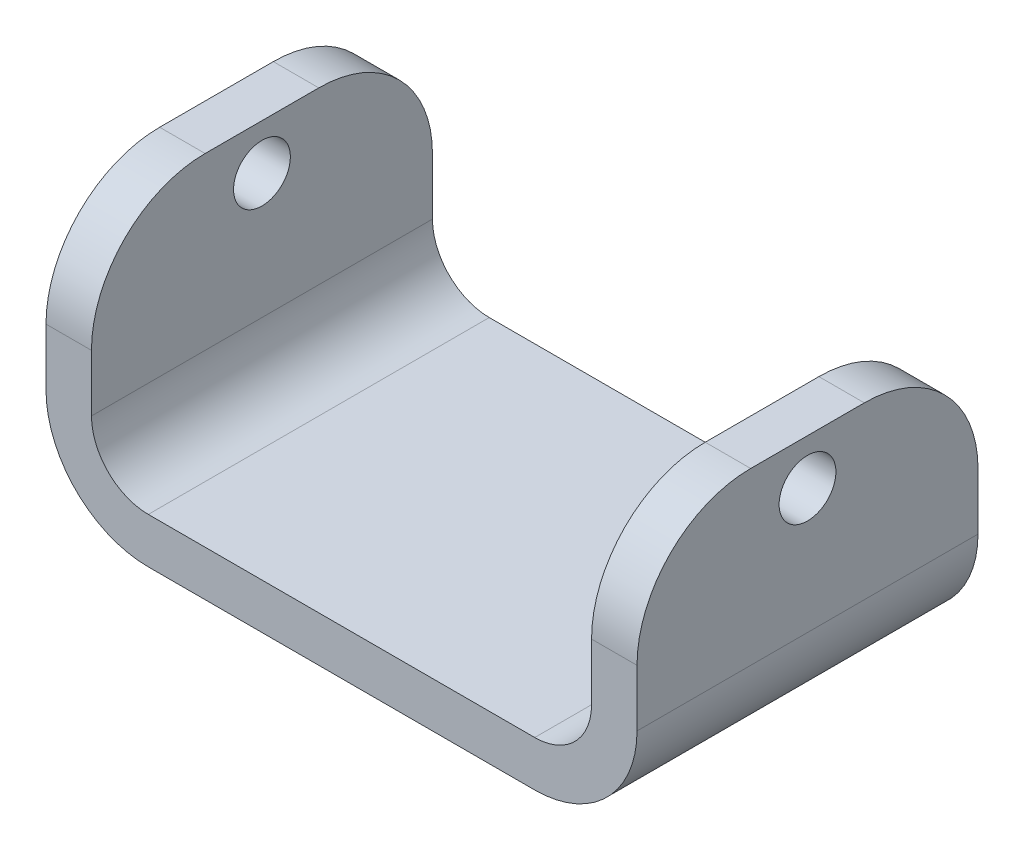
ISO-10303-21;
HEADER;
FILE_DESCRIPTION(('STEP AP214'),'2;1');
FILE_NAME('part.step','',(''),(''),'','','');
FILE_SCHEMA(('AUTOMOTIVE_DESIGN { 1 0 10303 214 1 1 1 1 }'));
ENDSEC;
DATA;
#1=APPLICATION_CONTEXT('core data for automotive mechanical design processes');
#2=APPLICATION_PROTOCOL_DEFINITION('international standard','automotive_design',2000,#1);
#3=PRODUCT_CONTEXT('',#1,'mechanical');
#4=PRODUCT('Part','Part','',(#3));
#5=PRODUCT_RELATED_PRODUCT_CATEGORY('part','',(#4));
#6=PRODUCT_DEFINITION_FORMATION('','',#4);
#7=PRODUCT_DEFINITION_CONTEXT('part definition',#1,'design');
#8=PRODUCT_DEFINITION('design','',#6,#7);
#9=PRODUCT_DEFINITION_SHAPE('','',#8);
#10=(LENGTH_UNIT() NAMED_UNIT(*) SI_UNIT(.MILLI.,.METRE.));
#11=(NAMED_UNIT(*) PLANE_ANGLE_UNIT() SI_UNIT($,.RADIAN.));
#12=(NAMED_UNIT(*) SI_UNIT($,.STERADIAN.) SOLID_ANGLE_UNIT());
#13=UNCERTAINTY_MEASURE_WITH_UNIT(LENGTH_MEASURE(1.E-05),#10,'distance_accuracy_value','');
#14=(GEOMETRIC_REPRESENTATION_CONTEXT(3) GLOBAL_UNCERTAINTY_ASSIGNED_CONTEXT((#13)) GLOBAL_UNIT_ASSIGNED_CONTEXT((#10,
#11,#12)) REPRESENTATION_CONTEXT('',''));
#15=CARTESIAN_POINT('',(0.,0.,0.));
#16=DIRECTION('',(0.,0.,1.));
#17=DIRECTION('',(1.,0.,0.));
#18=AXIS2_PLACEMENT_3D('',#15,#16,#17);
#19=CARTESIAN_POINT('',(27.94,25.4,0.));
#20=DIRECTION('',(0.,-1.,0.));
#21=DIRECTION('',(0.,0.,-1.));
#22=AXIS2_PLACEMENT_3D('',#19,#20,#21);
#23=PLANE('',#22);
#24=DIRECTION('',(0.,0.,-1.));
#25=VECTOR('',#24,1.);
#26=CARTESIAN_POINT('',(33.02,25.4,0.));
#27=LINE('',#26,#25);
#28=CARTESIAN_POINT('',(33.02,25.4,-6.35));
#29=VERTEX_POINT('',#28);
#30=CARTESIAN_POINT('',(33.02,25.4,6.35));
#31=VERTEX_POINT('',#30);
#32=EDGE_CURVE('E169',#29,#31,#27,.F.);
#33=ORIENTED_EDGE('',*,*,#32,.F.);
#34=DIRECTION('',(-1.,0.,0.));
#35=VECTOR('',#34,1.);
#36=CARTESIAN_POINT('',(27.94,25.4,-6.35));
#37=LINE('',#36,#35);
#38=CARTESIAN_POINT('',(27.94,25.4,-6.35));
#39=VERTEX_POINT('',#38);
#40=EDGE_CURVE('E292',#29,#39,#37,.T.);
#41=ORIENTED_EDGE('',*,*,#40,.T.);
#42=DIRECTION('',(0.,0.,-1.));
#43=VECTOR('',#42,1.);
#44=CARTESIAN_POINT('',(27.94,25.4,0.));
#45=LINE('',#44,#43);
#46=CARTESIAN_POINT('',(27.94,25.4,6.35));
#47=VERTEX_POINT('',#46);
#48=EDGE_CURVE('E270',#39,#47,#45,.F.);
#49=ORIENTED_EDGE('',*,*,#48,.T.);
#50=DIRECTION('',(-1.,0.,0.));
#51=VECTOR('',#50,1.);
#52=CARTESIAN_POINT('',(27.94,25.4,6.35));
#53=LINE('',#52,#51);
#54=EDGE_CURVE('E289',#47,#31,#53,.F.);
#55=ORIENTED_EDGE('',*,*,#54,.T.);
#56=EDGE_LOOP('',(#33,#41,#49,#55));
#57=FACE_BOUND('',#56,.T.);
#58=ADVANCED_FACE('F43',(#57),#23,.F.);
#59=CARTESIAN_POINT('',(0.,0.,19.05));
#60=DIRECTION('',(0.,0.,-1.));
#61=DIRECTION('',(1.,0.,0.));
#62=AXIS2_PLACEMENT_3D('',#59,#60,#61);
#63=PLANE('',#62);
#64=DIRECTION('',(0.,1.,0.));
#65=VECTOR('',#64,1.);
#66=CARTESIAN_POINT('',(33.02,0.,19.05));
#67=LINE('',#66,#65);
#68=CARTESIAN_POINT('',(33.02,6.35,19.05));
#69=VERTEX_POINT('',#68);
#70=CARTESIAN_POINT('',(33.02,12.7,19.05));
#71=VERTEX_POINT('',#70);
#72=EDGE_CURVE('E248',#69,#71,#67,.T.);
#73=ORIENTED_EDGE('',*,*,#72,.T.);
#74=DIRECTION('',(-1.,0.,0.));
#75=VECTOR('',#74,1.);
#76=CARTESIAN_POINT('',(0.,12.7,19.05));
#77=LINE('',#76,#75);
#78=CARTESIAN_POINT('',(27.94,12.7,19.05));
#79=VERTEX_POINT('',#78);
#80=EDGE_CURVE('E12',#71,#79,#77,.T.);
#81=ORIENTED_EDGE('',*,*,#80,.T.);
#82=DIRECTION('',(0.,1.,0.));
#83=VECTOR('',#82,1.);
#84=CARTESIAN_POINT('',(27.94,0.,19.05));
#85=LINE('',#84,#83);
#86=CARTESIAN_POINT('',(27.94,6.35,19.05));
#87=VERTEX_POINT('',#86);
#88=EDGE_CURVE('E264',#87,#79,#85,.T.);
#89=ORIENTED_EDGE('',*,*,#88,.F.);
#90=CARTESIAN_POINT('',(21.59,6.35,19.05));
#91=DIRECTION('',(0.,0.,1.));
#92=DIRECTION('',(1.,0.,0.));
#93=AXIS2_PLACEMENT_3D('',#90,#91,#92);
#94=CIRCLE('',#93,6.35);
#95=CARTESIAN_POINT('',(21.59,0.,19.05));
#96=VERTEX_POINT('',#95);
#97=EDGE_CURVE('E278',#87,#96,#94,.F.);
#98=ORIENTED_EDGE('',*,*,#97,.T.);
#99=DIRECTION('',(1.,0.,0.));
#100=VECTOR('',#99,1.);
#101=CARTESIAN_POINT('',(0.,0.,19.05));
#102=LINE('',#101,#100);
#103=CARTESIAN_POINT('',(-21.59,0.,19.05));
#104=VERTEX_POINT('',#103);
#105=EDGE_CURVE('E266',#104,#96,#102,.T.);
#106=ORIENTED_EDGE('',*,*,#105,.F.);
#107=CARTESIAN_POINT('',(-21.59,6.35,19.05));
#108=DIRECTION('',(0.,0.,-1.));
#109=DIRECTION('',(-1.,0.,0.));
#110=AXIS2_PLACEMENT_3D('',#107,#108,#109);
#111=CIRCLE('',#110,6.35);
#112=CARTESIAN_POINT('',(-27.94,6.35,19.05));
#113=VERTEX_POINT('',#112);
#114=EDGE_CURVE('E210',#113,#104,#111,.F.);
#115=ORIENTED_EDGE('',*,*,#114,.F.);
#116=DIRECTION('',(0.,1.,0.));
#117=VECTOR('',#116,1.);
#118=CARTESIAN_POINT('',(-27.94,0.,19.05));
#119=LINE('',#118,#117);
#120=CARTESIAN_POINT('',(-27.94,12.7,19.05));
#121=VERTEX_POINT('',#120);
#122=EDGE_CURVE('E198',#113,#121,#119,.T.);
#123=ORIENTED_EDGE('',*,*,#122,.T.);
#124=DIRECTION('',(1.,0.,0.));
#125=VECTOR('',#124,1.);
#126=CARTESIAN_POINT('',(0.,12.7,19.05));
#127=LINE('',#126,#125);
#128=CARTESIAN_POINT('',(-33.02,12.7,19.05));
#129=VERTEX_POINT('',#128);
#130=EDGE_CURVE('E233',#129,#121,#127,.T.);
#131=ORIENTED_EDGE('',*,*,#130,.F.);
#132=DIRECTION('',(0.,1.,0.));
#133=VECTOR('',#132,1.);
#134=CARTESIAN_POINT('',(-33.02,0.,19.05));
#135=LINE('',#134,#133);
#136=CARTESIAN_POINT('',(-33.02,6.35,19.05));
#137=VERTEX_POINT('',#136);
#138=EDGE_CURVE('E184',#137,#129,#135,.T.);
#139=ORIENTED_EDGE('',*,*,#138,.F.);
#140=CARTESIAN_POINT('',(-21.59,6.35,19.05));
#141=DIRECTION('',(0.,0.,-1.));
#142=DIRECTION('',(-1.,0.,0.));
#143=AXIS2_PLACEMENT_3D('',#140,#141,#142);
#144=CIRCLE('',#143,11.43);
#145=CARTESIAN_POINT('',(-21.59,-5.08,19.05));
#146=VERTEX_POINT('',#145);
#147=EDGE_CURVE('E174',#137,#146,#144,.F.);
#148=ORIENTED_EDGE('',*,*,#147,.T.);
#149=DIRECTION('',(1.,0.,0.));
#150=VECTOR('',#149,1.);
#151=CARTESIAN_POINT('',(0.,-5.08,19.05));
#152=LINE('',#151,#150);
#153=CARTESIAN_POINT('',(21.59,-5.08,19.05));
#154=VERTEX_POINT('',#153);
#155=EDGE_CURVE('E160',#146,#154,#152,.T.);
#156=ORIENTED_EDGE('',*,*,#155,.T.);
#157=CARTESIAN_POINT('',(21.59,6.35,19.05));
#158=DIRECTION('',(0.,0.,1.));
#159=DIRECTION('',(1.,0.,0.));
#160=AXIS2_PLACEMENT_3D('',#157,#158,#159);
#161=CIRCLE('',#160,11.43);
#162=EDGE_CURVE('E251',#69,#154,#161,.F.);
#163=ORIENTED_EDGE('',*,*,#162,.F.);
#164=EDGE_LOOP('',(#73,#81,#89,#98,#106,#115,#123,#131,#139,#148,#156,#163));
#165=FACE_BOUND('',#164,.T.);
#166=ADVANCED_FACE('F181',(#165),#63,.F.);
#167=CARTESIAN_POINT('',(21.59,6.35,-19.05));
#168=DIRECTION('',(0.,0.,1.));
#169=DIRECTION('',(1.,0.,0.));
#170=AXIS2_PLACEMENT_3D('',#167,#168,#169);
#171=PLANE('',#170);
#172=DIRECTION('',(0.,1.,0.));
#173=VECTOR('',#172,1.);
#174=CARTESIAN_POINT('',(27.94,0.,-19.05));
#175=LINE('',#174,#173);
#176=CARTESIAN_POINT('',(27.94,6.35,-19.05));
#177=VERTEX_POINT('',#176);
#178=CARTESIAN_POINT('',(27.94,12.7,-19.05));
#179=VERTEX_POINT('',#178);
#180=EDGE_CURVE('E265',#177,#179,#175,.T.);
#181=ORIENTED_EDGE('',*,*,#180,.T.);
#182=DIRECTION('',(-1.,0.,0.));
#183=VECTOR('',#182,1.);
#184=CARTESIAN_POINT('',(21.59,12.7,-19.05));
#185=LINE('',#184,#183);
#186=CARTESIAN_POINT('',(33.02,12.7,-19.05));
#187=VERTEX_POINT('',#186);
#188=EDGE_CURVE('E246',#179,#187,#185,.F.);
#189=ORIENTED_EDGE('',*,*,#188,.T.);
#190=DIRECTION('',(0.,1.,0.));
#191=VECTOR('',#190,1.);
#192=CARTESIAN_POINT('',(33.02,0.,-19.05));
#193=LINE('',#192,#191);
#194=CARTESIAN_POINT('',(33.02,6.35,-19.05));
#195=VERTEX_POINT('',#194);
#196=EDGE_CURVE('E249',#195,#187,#193,.T.);
#197=ORIENTED_EDGE('',*,*,#196,.F.);
#198=CARTESIAN_POINT('',(21.59,6.35,-19.05));
#199=DIRECTION('',(0.,0.,1.));
#200=DIRECTION('',(1.,0.,0.));
#201=AXIS2_PLACEMENT_3D('',#198,#199,#200);
#202=CIRCLE('',#201,11.43);
#203=CARTESIAN_POINT('',(21.59,-5.08,-19.05));
#204=VERTEX_POINT('',#203);
#205=EDGE_CURVE('E253',#204,#195,#202,.T.);
#206=ORIENTED_EDGE('',*,*,#205,.F.);
#207=DIRECTION('',(1.,0.,0.));
#208=VECTOR('',#207,1.);
#209=CARTESIAN_POINT('',(0.,-5.08,-19.05));
#210=LINE('',#209,#208);
#211=CARTESIAN_POINT('',(-21.59,-5.08,-19.05));
#212=VERTEX_POINT('',#211);
#213=EDGE_CURVE('E247',#212,#204,#210,.T.);
#214=ORIENTED_EDGE('',*,*,#213,.F.);
#215=CARTESIAN_POINT('',(-21.59,6.35,-19.05));
#216=DIRECTION('',(0.,0.,-1.));
#217=DIRECTION('',(-1.,0.,0.));
#218=AXIS2_PLACEMENT_3D('',#215,#216,#217);
#219=CIRCLE('',#218,11.43);
#220=CARTESIAN_POINT('',(-33.02,6.35,-19.05));
#221=VERTEX_POINT('',#220);
#222=EDGE_CURVE('E177',#212,#221,#219,.T.);
#223=ORIENTED_EDGE('',*,*,#222,.T.);
#224=DIRECTION('',(0.,1.,0.));
#225=VECTOR('',#224,1.);
#226=CARTESIAN_POINT('',(-33.02,0.,-19.05));
#227=LINE('',#226,#225);
#228=CARTESIAN_POINT('',(-33.02,12.7,-19.05));
#229=VERTEX_POINT('',#228);
#230=EDGE_CURVE('E187',#221,#229,#227,.T.);
#231=ORIENTED_EDGE('',*,*,#230,.T.);
#232=DIRECTION('',(1.,0.,0.));
#233=VECTOR('',#232,1.);
#234=CARTESIAN_POINT('',(-21.59,12.7,-19.05));
#235=LINE('',#234,#233);
#236=CARTESIAN_POINT('',(-27.94,12.7,-19.05));
#237=VERTEX_POINT('',#236);
#238=EDGE_CURVE('E216',#237,#229,#235,.F.);
#239=ORIENTED_EDGE('',*,*,#238,.F.);
#240=DIRECTION('',(0.,1.,0.));
#241=VECTOR('',#240,1.);
#242=CARTESIAN_POINT('',(-27.94,0.,-19.05));
#243=LINE('',#242,#241);
#244=CARTESIAN_POINT('',(-27.94,6.35,-19.05));
#245=VERTEX_POINT('',#244);
#246=EDGE_CURVE('E202',#245,#237,#243,.T.);
#247=ORIENTED_EDGE('',*,*,#246,.F.);
#248=CARTESIAN_POINT('',(-21.59,6.35,-19.05));
#249=DIRECTION('',(0.,0.,1.));
#250=DIRECTION('',(1.,0.,0.));
#251=AXIS2_PLACEMENT_3D('',#248,#249,#250);
#252=CIRCLE('',#251,6.35);
#253=CARTESIAN_POINT('',(-21.59,0.,-19.05));
#254=VERTEX_POINT('',#253);
#255=EDGE_CURVE('E207',#254,#245,#252,.F.);
#256=ORIENTED_EDGE('',*,*,#255,.F.);
#257=DIRECTION('',(1.,0.,0.));
#258=VECTOR('',#257,1.);
#259=CARTESIAN_POINT('',(0.,0.,-19.05));
#260=LINE('',#259,#258);
#261=CARTESIAN_POINT('',(21.59,0.,-19.05));
#262=VERTEX_POINT('',#261);
#263=EDGE_CURVE('E261',#254,#262,#260,.T.);
#264=ORIENTED_EDGE('',*,*,#263,.T.);
#265=CARTESIAN_POINT('',(21.59,6.35,-19.05));
#266=DIRECTION('',(0.,0.,-1.));
#267=DIRECTION('',(-1.,0.,0.));
#268=AXIS2_PLACEMENT_3D('',#265,#266,#267);
#269=CIRCLE('',#268,6.35);
#270=EDGE_CURVE('E275',#262,#177,#269,.F.);
#271=ORIENTED_EDGE('',*,*,#270,.T.);
#272=EDGE_LOOP('',(#181,#189,#197,#206,#214,#223,#231,#239,#247,#256,#264,#271));
#273=FACE_BOUND('',#272,.T.);
#274=ADVANCED_FACE('F321',(#273),#171,.F.);
#275=CARTESIAN_POINT('',(0.,-5.08,0.));
#276=DIRECTION('',(0.,-1.,0.));
#277=DIRECTION('',(0.,0.,-1.));
#278=AXIS2_PLACEMENT_3D('',#275,#276,#277);
#279=PLANE('',#278);
#280=ORIENTED_EDGE('',*,*,#213,.T.);
#281=DIRECTION('',(0.,0.,-1.));
#282=VECTOR('',#281,1.);
#283=CARTESIAN_POINT('',(21.59,-5.08,0.));
#284=LINE('',#283,#282);
#285=EDGE_CURVE('E166',#204,#154,#284,.F.);
#286=ORIENTED_EDGE('',*,*,#285,.T.);
#287=ORIENTED_EDGE('',*,*,#155,.F.);
#288=DIRECTION('',(0.,0.,-1.));
#289=VECTOR('',#288,1.);
#290=CARTESIAN_POINT('',(-21.59,-5.08,0.));
#291=LINE('',#290,#289);
#292=EDGE_CURVE('E163',#212,#146,#291,.F.);
#293=ORIENTED_EDGE('',*,*,#292,.F.);
#294=EDGE_LOOP('',(#280,#286,#287,#293));
#295=FACE_BOUND('',#294,.T.);
#296=ADVANCED_FACE('F162',(#295),#279,.T.);
#297=CARTESIAN_POINT('',(33.02,0.,0.));
#298=DIRECTION('',(1.,0.,0.));
#299=DIRECTION('',(0.,0.,-1.));
#300=AXIS2_PLACEMENT_3D('',#297,#298,#299);
#301=PLANE('',#300);
#302=CARTESIAN_POINT('',(33.02,20.32,0.));
#303=DIRECTION('',(1.,0.,0.));
#304=DIRECTION('',(0.,0.,-1.));
#305=AXIS2_PLACEMENT_3D('',#302,#303,#304);
#306=CIRCLE('',#305,3.175);
#307=CARTESIAN_POINT('',(33.02,20.32,-3.175));
#308=VERTEX_POINT('',#307);
#309=EDGE_CURVE('E236',#308,#308,#306,.T.);
#310=ORIENTED_EDGE('',*,*,#309,.F.);
#311=EDGE_LOOP('',(#310));
#312=FACE_BOUND('',#311,.T.);
#313=ORIENTED_EDGE('',*,*,#196,.T.);
#314=CARTESIAN_POINT('',(33.02,12.7,-6.35));
#315=DIRECTION('',(1.,0.,0.));
#316=DIRECTION('',(0.,0.,-1.));
#317=AXIS2_PLACEMENT_3D('',#314,#315,#316);
#318=CIRCLE('',#317,12.7);
#319=EDGE_CURVE('E287',#187,#29,#318,.T.);
#320=ORIENTED_EDGE('',*,*,#319,.T.);
#321=ORIENTED_EDGE('',*,*,#32,.T.);
#322=CARTESIAN_POINT('',(33.02,12.7,6.35));
#323=DIRECTION('',(1.,0.,0.));
#324=DIRECTION('',(0.,0.,-1.));
#325=AXIS2_PLACEMENT_3D('',#322,#323,#324);
#326=CIRCLE('',#325,12.7);
#327=EDGE_CURVE('E285',#31,#71,#326,.T.);
#328=ORIENTED_EDGE('',*,*,#327,.T.);
#329=ORIENTED_EDGE('',*,*,#72,.F.);
#330=DIRECTION('',(0.,0.,-1.));
#331=VECTOR('',#330,1.);
#332=CARTESIAN_POINT('',(33.02,6.35,0.));
#333=LINE('',#332,#331);
#334=EDGE_CURVE('E243',#69,#195,#333,.T.);
#335=ORIENTED_EDGE('',*,*,#334,.T.);
#336=EDGE_LOOP('',(#313,#320,#321,#328,#329,#335));
#337=FACE_BOUND('',#336,.T.);
#338=ADVANCED_FACE('F346',(#312,#337),#301,.T.);
#339=CARTESIAN_POINT('',(21.59,6.35,0.));
#340=DIRECTION('',(0.,0.,1.));
#341=DIRECTION('',(1.,0.,0.));
#342=AXIS2_PLACEMENT_3D('',#339,#340,#341);
#343=CYLINDRICAL_SURFACE('',#342,11.43);
#344=ORIENTED_EDGE('',*,*,#205,.T.);
#345=ORIENTED_EDGE('',*,*,#334,.F.);
#346=ORIENTED_EDGE('',*,*,#162,.T.);
#347=ORIENTED_EDGE('',*,*,#285,.F.);
#348=EDGE_LOOP('',(#344,#345,#346,#347));
#349=FACE_BOUND('',#348,.T.);
#350=ADVANCED_FACE('F350',(#349),#343,.T.);
#351=CARTESIAN_POINT('',(0.,0.,0.));
#352=DIRECTION('',(0.,-1.,0.));
#353=DIRECTION('',(0.,0.,-1.));
#354=AXIS2_PLACEMENT_3D('',#351,#352,#353);
#355=PLANE('',#354);
#356=ORIENTED_EDGE('',*,*,#263,.F.);
#357=DIRECTION('',(0.,0.,1.));
#358=VECTOR('',#357,1.);
#359=CARTESIAN_POINT('',(-21.59,0.,0.));
#360=LINE('',#359,#358);
#361=EDGE_CURVE('E189',#254,#104,#360,.T.);
#362=ORIENTED_EDGE('',*,*,#361,.T.);
#363=ORIENTED_EDGE('',*,*,#105,.T.);
#364=DIRECTION('',(0.,0.,1.));
#365=VECTOR('',#364,1.);
#366=CARTESIAN_POINT('',(21.59,0.,0.));
#367=LINE('',#366,#365);
#368=EDGE_CURVE('E269',#262,#96,#367,.T.);
#369=ORIENTED_EDGE('',*,*,#368,.F.);
#370=EDGE_LOOP('',(#356,#362,#363,#369));
#371=FACE_BOUND('',#370,.T.);
#372=ADVANCED_FACE('F352',(#371),#355,.F.);
#373=CARTESIAN_POINT('',(27.94,0.,0.));
#374=DIRECTION('',(1.,0.,0.));
#375=DIRECTION('',(0.,0.,-1.));
#376=AXIS2_PLACEMENT_3D('',#373,#374,#375);
#377=PLANE('',#376);
#378=CARTESIAN_POINT('',(27.94,20.32,0.));
#379=DIRECTION('',(1.,0.,0.));
#380=DIRECTION('',(0.,0.,-1.));
#381=AXIS2_PLACEMENT_3D('',#378,#379,#380);
#382=CIRCLE('',#381,3.175);
#383=CARTESIAN_POINT('',(27.94,20.32,-3.175));
#384=VERTEX_POINT('',#383);
#385=EDGE_CURVE('E47',#384,#384,#382,.T.);
#386=ORIENTED_EDGE('',*,*,#385,.T.);
#387=EDGE_LOOP('',(#386));
#388=FACE_BOUND('',#387,.T.);
#389=ORIENTED_EDGE('',*,*,#48,.F.);
#390=CARTESIAN_POINT('',(27.94,12.7,-6.35));
#391=DIRECTION('',(1.,0.,0.));
#392=DIRECTION('',(0.,0.,-1.));
#393=AXIS2_PLACEMENT_3D('',#390,#391,#392);
#394=CIRCLE('',#393,12.7);
#395=EDGE_CURVE('E52',#39,#179,#394,.F.);
#396=ORIENTED_EDGE('',*,*,#395,.T.);
#397=ORIENTED_EDGE('',*,*,#180,.F.);
#398=DIRECTION('',(0.,0.,1.));
#399=VECTOR('',#398,1.);
#400=CARTESIAN_POINT('',(27.94,6.35,0.));
#401=LINE('',#400,#399);
#402=EDGE_CURVE('E254',#87,#177,#401,.F.);
#403=ORIENTED_EDGE('',*,*,#402,.F.);
#404=ORIENTED_EDGE('',*,*,#88,.T.);
#405=CARTESIAN_POINT('',(27.94,12.7,6.35));
#406=DIRECTION('',(1.,0.,0.));
#407=DIRECTION('',(0.,0.,-1.));
#408=AXIS2_PLACEMENT_3D('',#405,#406,#407);
#409=CIRCLE('',#408,12.7);
#410=EDGE_CURVE('E65',#79,#47,#409,.F.);
#411=ORIENTED_EDGE('',*,*,#410,.T.);
#412=EDGE_LOOP('',(#389,#396,#397,#403,#404,#411));
#413=FACE_BOUND('',#412,.T.);
#414=ADVANCED_FACE('F301',(#388,#413),#377,.F.);
#415=CARTESIAN_POINT('',(21.59,6.35,0.));
#416=DIRECTION('',(0.,0.,1.));
#417=DIRECTION('',(1.,0.,0.));
#418=AXIS2_PLACEMENT_3D('',#415,#416,#417);
#419=CYLINDRICAL_SURFACE('',#418,6.35);
#420=ORIENTED_EDGE('',*,*,#270,.F.);
#421=ORIENTED_EDGE('',*,*,#368,.T.);
#422=ORIENTED_EDGE('',*,*,#97,.F.);
#423=ORIENTED_EDGE('',*,*,#402,.T.);
#424=EDGE_LOOP('',(#420,#421,#422,#423));
#425=FACE_BOUND('',#424,.T.);
#426=ADVANCED_FACE('F330',(#425),#419,.F.);
#427=CARTESIAN_POINT('',(21.59,12.7,-6.35));
#428=DIRECTION('',(1.,0.,0.));
#429=DIRECTION('',(0.,0.,-1.));
#430=AXIS2_PLACEMENT_3D('',#427,#428,#429);
#431=CYLINDRICAL_SURFACE('',#430,12.7);
#432=ORIENTED_EDGE('',*,*,#395,.F.);
#433=ORIENTED_EDGE('',*,*,#40,.F.);
#434=ORIENTED_EDGE('',*,*,#319,.F.);
#435=ORIENTED_EDGE('',*,*,#188,.F.);
#436=EDGE_LOOP('',(#432,#433,#434,#435));
#437=FACE_BOUND('',#436,.T.);
#438=ADVANCED_FACE('F313',(#437),#431,.T.);
#439=CARTESIAN_POINT('',(27.94,12.7,6.35));
#440=DIRECTION('',(1.,0.,0.));
#441=DIRECTION('',(0.,0.,-1.));
#442=AXIS2_PLACEMENT_3D('',#439,#440,#441);
#443=CYLINDRICAL_SURFACE('',#442,12.7);
#444=ORIENTED_EDGE('',*,*,#410,.F.);
#445=ORIENTED_EDGE('',*,*,#80,.F.);
#446=ORIENTED_EDGE('',*,*,#327,.F.);
#447=ORIENTED_EDGE('',*,*,#54,.F.);
#448=EDGE_LOOP('',(#444,#445,#446,#447));
#449=FACE_BOUND('',#448,.T.);
#450=ADVANCED_FACE('F305',(#449),#443,.T.);
#451=CARTESIAN_POINT('',(0.,20.32,0.));
#452=DIRECTION('',(1.,0.,0.));
#453=DIRECTION('',(0.,0.,-1.));
#454=AXIS2_PLACEMENT_3D('',#451,#452,#453);
#455=CYLINDRICAL_SURFACE('',#454,3.175);
#456=ORIENTED_EDGE('',*,*,#309,.T.);
#457=EDGE_LOOP('',(#456));
#458=FACE_BOUND('',#457,.T.);
#459=ORIENTED_EDGE('',*,*,#385,.F.);
#460=EDGE_LOOP('',(#459));
#461=FACE_BOUND('',#460,.T.);
#462=ADVANCED_FACE('F45',(#458,#461),#455,.F.);
#463=CARTESIAN_POINT('',(-27.94,25.4,0.));
#464=DIRECTION('',(0.,-1.,0.));
#465=DIRECTION('',(0.,0.,-1.));
#466=AXIS2_PLACEMENT_3D('',#463,#464,#465);
#467=PLANE('',#466);
#468=DIRECTION('',(0.,0.,-1.));
#469=VECTOR('',#468,1.);
#470=CARTESIAN_POINT('',(-33.02,25.4,0.));
#471=LINE('',#470,#469);
#472=CARTESIAN_POINT('',(-33.02,25.4,-6.35));
#473=VERTEX_POINT('',#472);
#474=CARTESIAN_POINT('',(-33.02,25.4,6.35));
#475=VERTEX_POINT('',#474);
#476=EDGE_CURVE('E179',#473,#475,#471,.F.);
#477=ORIENTED_EDGE('',*,*,#476,.T.);
#478=DIRECTION('',(1.,0.,0.));
#479=VECTOR('',#478,1.);
#480=CARTESIAN_POINT('',(-27.94,25.4,6.35));
#481=LINE('',#480,#479);
#482=CARTESIAN_POINT('',(-27.94,25.4,6.35));
#483=VERTEX_POINT('',#482);
#484=EDGE_CURVE('E223',#483,#475,#481,.F.);
#485=ORIENTED_EDGE('',*,*,#484,.F.);
#486=DIRECTION('',(0.,0.,-1.));
#487=VECTOR('',#486,1.);
#488=CARTESIAN_POINT('',(-27.94,25.4,0.));
#489=LINE('',#488,#487);
#490=CARTESIAN_POINT('',(-27.94,25.4,-6.35));
#491=VERTEX_POINT('',#490);
#492=EDGE_CURVE('E201',#491,#483,#489,.F.);
#493=ORIENTED_EDGE('',*,*,#492,.F.);
#494=DIRECTION('',(1.,0.,0.));
#495=VECTOR('',#494,1.);
#496=CARTESIAN_POINT('',(-27.94,25.4,-6.35));
#497=LINE('',#496,#495);
#498=EDGE_CURVE('E226',#473,#491,#497,.T.);
#499=ORIENTED_EDGE('',*,*,#498,.F.);
#500=EDGE_LOOP('',(#477,#485,#493,#499));
#501=FACE_BOUND('',#500,.T.);
#502=ADVANCED_FACE('F304',(#501),#467,.F.);
#503=CARTESIAN_POINT('',(-33.02,0.,0.));
#504=DIRECTION('',(-1.,0.,0.));
#505=DIRECTION('',(0.,0.,-1.));
#506=AXIS2_PLACEMENT_3D('',#503,#504,#505);
#507=PLANE('',#506);
#508=CARTESIAN_POINT('',(-33.02,20.32,0.));
#509=DIRECTION('',(1.,0.,0.));
#510=DIRECTION('',(0.,0.,-1.));
#511=AXIS2_PLACEMENT_3D('',#508,#509,#510);
#512=CIRCLE('',#511,3.175);
#513=CARTESIAN_POINT('',(-33.02,20.32,-3.175));
#514=VERTEX_POINT('',#513);
#515=EDGE_CURVE('E237',#514,#514,#512,.T.);
#516=ORIENTED_EDGE('',*,*,#515,.T.);
#517=EDGE_LOOP('',(#516));
#518=FACE_BOUND('',#517,.T.);
#519=ORIENTED_EDGE('',*,*,#230,.F.);
#520=DIRECTION('',(0.,0.,-1.));
#521=VECTOR('',#520,1.);
#522=CARTESIAN_POINT('',(-33.02,6.35,0.));
#523=LINE('',#522,#521);
#524=EDGE_CURVE('E178',#137,#221,#523,.T.);
#525=ORIENTED_EDGE('',*,*,#524,.F.);
#526=ORIENTED_EDGE('',*,*,#138,.T.);
#527=CARTESIAN_POINT('',(-33.02,12.7,6.35));
#528=DIRECTION('',(1.,0.,0.));
#529=DIRECTION('',(0.,0.,-1.));
#530=AXIS2_PLACEMENT_3D('',#527,#528,#529);
#531=CIRCLE('',#530,12.7);
#532=EDGE_CURVE('E219',#475,#129,#531,.T.);
#533=ORIENTED_EDGE('',*,*,#532,.F.);
#534=ORIENTED_EDGE('',*,*,#476,.F.);
#535=CARTESIAN_POINT('',(-33.02,12.7,-6.35));
#536=DIRECTION('',(1.,0.,0.));
#537=DIRECTION('',(0.,0.,-1.));
#538=AXIS2_PLACEMENT_3D('',#535,#536,#537);
#539=CIRCLE('',#538,12.7);
#540=EDGE_CURVE('E221',#229,#473,#539,.T.);
#541=ORIENTED_EDGE('',*,*,#540,.F.);
#542=EDGE_LOOP('',(#519,#525,#526,#533,#534,#541));
#543=FACE_BOUND('',#542,.T.);
#544=ADVANCED_FACE('F310',(#518,#543),#507,.T.);
#545=CARTESIAN_POINT('',(-21.59,6.35,0.));
#546=DIRECTION('',(0.,0.,1.));
#547=DIRECTION('',(-1.,0.,0.));
#548=AXIS2_PLACEMENT_3D('',#545,#546,#547);
#549=CYLINDRICAL_SURFACE('',#548,11.43);
#550=ORIENTED_EDGE('',*,*,#222,.F.);
#551=ORIENTED_EDGE('',*,*,#292,.T.);
#552=ORIENTED_EDGE('',*,*,#147,.F.);
#553=ORIENTED_EDGE('',*,*,#524,.T.);
#554=EDGE_LOOP('',(#550,#551,#552,#553));
#555=FACE_BOUND('',#554,.T.);
#556=ADVANCED_FACE('F173',(#555),#549,.T.);
#557=CARTESIAN_POINT('',(-27.94,0.,0.));
#558=DIRECTION('',(-1.,0.,0.));
#559=DIRECTION('',(0.,0.,-1.));
#560=AXIS2_PLACEMENT_3D('',#557,#558,#559);
#561=PLANE('',#560);
#562=CARTESIAN_POINT('',(-27.94,20.32,0.));
#563=DIRECTION('',(1.,0.,0.));
#564=DIRECTION('',(0.,0.,-1.));
#565=AXIS2_PLACEMENT_3D('',#562,#563,#564);
#566=CIRCLE('',#565,3.175);
#567=CARTESIAN_POINT('',(-27.94,20.32,-3.175));
#568=VERTEX_POINT('',#567);
#569=EDGE_CURVE('E213',#568,#568,#566,.T.);
#570=ORIENTED_EDGE('',*,*,#569,.F.);
#571=EDGE_LOOP('',(#570));
#572=FACE_BOUND('',#571,.T.);
#573=ORIENTED_EDGE('',*,*,#492,.T.);
#574=CARTESIAN_POINT('',(-27.94,12.7,6.35));
#575=DIRECTION('',(1.,0.,0.));
#576=DIRECTION('',(0.,0.,-1.));
#577=AXIS2_PLACEMENT_3D('',#574,#575,#576);
#578=CIRCLE('',#577,12.7);
#579=EDGE_CURVE('E229',#121,#483,#578,.F.);
#580=ORIENTED_EDGE('',*,*,#579,.F.);
#581=ORIENTED_EDGE('',*,*,#122,.F.);
#582=DIRECTION('',(0.,0.,1.));
#583=VECTOR('',#582,1.);
#584=CARTESIAN_POINT('',(-27.94,6.35,0.));
#585=LINE('',#584,#583);
#586=EDGE_CURVE('E185',#113,#245,#585,.F.);
#587=ORIENTED_EDGE('',*,*,#586,.T.);
#588=ORIENTED_EDGE('',*,*,#246,.T.);
#589=CARTESIAN_POINT('',(-27.94,12.7,-6.35));
#590=DIRECTION('',(1.,0.,0.));
#591=DIRECTION('',(0.,0.,-1.));
#592=AXIS2_PLACEMENT_3D('',#589,#590,#591);
#593=CIRCLE('',#592,12.7);
#594=EDGE_CURVE('E231',#491,#237,#593,.F.);
#595=ORIENTED_EDGE('',*,*,#594,.F.);
#596=EDGE_LOOP('',(#573,#580,#581,#587,#588,#595));
#597=FACE_BOUND('',#596,.T.);
#598=ADVANCED_FACE('F419',(#572,#597),#561,.F.);
#599=CARTESIAN_POINT('',(-21.59,6.35,0.));
#600=DIRECTION('',(0.,0.,1.));
#601=DIRECTION('',(-1.,0.,0.));
#602=AXIS2_PLACEMENT_3D('',#599,#600,#601);
#603=CYLINDRICAL_SURFACE('',#602,6.35);
#604=ORIENTED_EDGE('',*,*,#255,.T.);
#605=ORIENTED_EDGE('',*,*,#586,.F.);
#606=ORIENTED_EDGE('',*,*,#114,.T.);
#607=ORIENTED_EDGE('',*,*,#361,.F.);
#608=EDGE_LOOP('',(#604,#605,#606,#607));
#609=FACE_BOUND('',#608,.T.);
#610=ADVANCED_FACE('F427',(#609),#603,.F.);
#611=CARTESIAN_POINT('',(-21.59,12.7,-6.35));
#612=DIRECTION('',(-1.,0.,0.));
#613=DIRECTION('',(0.,0.,-1.));
#614=AXIS2_PLACEMENT_3D('',#611,#612,#613);
#615=CYLINDRICAL_SURFACE('',#614,12.7);
#616=ORIENTED_EDGE('',*,*,#594,.T.);
#617=ORIENTED_EDGE('',*,*,#238,.T.);
#618=ORIENTED_EDGE('',*,*,#540,.T.);
#619=ORIENTED_EDGE('',*,*,#498,.T.);
#620=EDGE_LOOP('',(#616,#617,#618,#619));
#621=FACE_BOUND('',#620,.T.);
#622=ADVANCED_FACE('F436',(#621),#615,.T.);
#623=CARTESIAN_POINT('',(-27.94,12.7,6.35));
#624=DIRECTION('',(-1.,0.,0.));
#625=DIRECTION('',(0.,0.,-1.));
#626=AXIS2_PLACEMENT_3D('',#623,#624,#625);
#627=CYLINDRICAL_SURFACE('',#626,12.7);
#628=ORIENTED_EDGE('',*,*,#579,.T.);
#629=ORIENTED_EDGE('',*,*,#484,.T.);
#630=ORIENTED_EDGE('',*,*,#532,.T.);
#631=ORIENTED_EDGE('',*,*,#130,.T.);
#632=EDGE_LOOP('',(#628,#629,#630,#631));
#633=FACE_BOUND('',#632,.T.);
#634=ADVANCED_FACE('F445',(#633),#627,.T.);
#635=CARTESIAN_POINT('',(0.,20.32,0.));
#636=DIRECTION('',(-1.,0.,0.));
#637=DIRECTION('',(0.,0.,-1.));
#638=AXIS2_PLACEMENT_3D('',#635,#636,#637);
#639=CYLINDRICAL_SURFACE('',#638,3.175);
#640=ORIENTED_EDGE('',*,*,#515,.F.);
#641=EDGE_LOOP('',(#640));
#642=FACE_BOUND('',#641,.T.);
#643=ORIENTED_EDGE('',*,*,#569,.T.);
#644=EDGE_LOOP('',(#643));
#645=FACE_BOUND('',#644,.T.);
#646=ADVANCED_FACE('F454',(#642,#645),#639,.F.);
#647=CLOSED_SHELL('',(#58,#166,#274,#296,#338,#350,#372,#414,#426,#438,#450,#462,#502,#544,#556,
#598,#610,#622,#634,#646));
#648=MANIFOLD_SOLID_BREP('B2',#647);
#649=ADVANCED_BREP_SHAPE_REPRESENTATION('',(#18,#648),#14);
#650=SHAPE_DEFINITION_REPRESENTATION(#9,#649);
ENDSEC;
END-ISO-10303-21;
